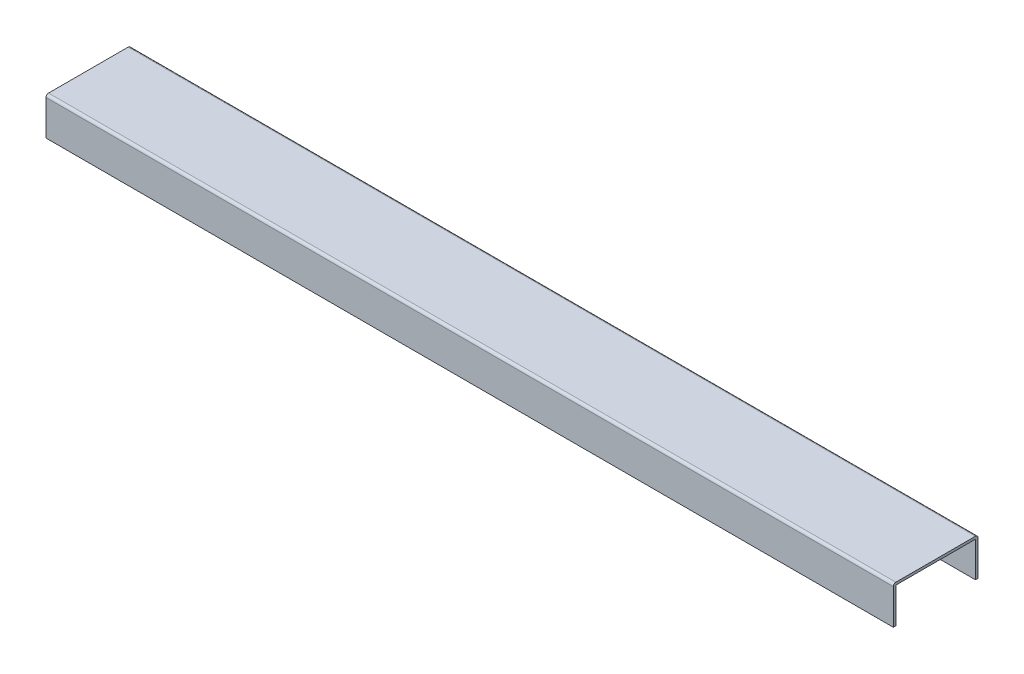
ISO-10303-21;
HEADER;
FILE_DESCRIPTION(('STEP AP214'),'2;1');
FILE_NAME('part.step','',(''),(''),'','','');
FILE_SCHEMA(('AUTOMOTIVE_DESIGN { 1 0 10303 214 1 1 1 1 }'));
ENDSEC;
DATA;
#1=APPLICATION_CONTEXT('core data for automotive mechanical design processes');
#2=APPLICATION_PROTOCOL_DEFINITION('international standard','automotive_design',2000,#1);
#3=PRODUCT_CONTEXT('',#1,'mechanical');
#4=PRODUCT('Part','Part','',(#3));
#5=PRODUCT_RELATED_PRODUCT_CATEGORY('part','',(#4));
#6=PRODUCT_DEFINITION_FORMATION('','',#4);
#7=PRODUCT_DEFINITION_CONTEXT('part definition',#1,'design');
#8=PRODUCT_DEFINITION('design','',#6,#7);
#9=PRODUCT_DEFINITION_SHAPE('','',#8);
#10=(LENGTH_UNIT() NAMED_UNIT(*) SI_UNIT(.MILLI.,.METRE.));
#11=(NAMED_UNIT(*) PLANE_ANGLE_UNIT() SI_UNIT($,.RADIAN.));
#12=(NAMED_UNIT(*) SI_UNIT($,.STERADIAN.) SOLID_ANGLE_UNIT());
#13=UNCERTAINTY_MEASURE_WITH_UNIT(LENGTH_MEASURE(1.E-05),#10,'distance_accuracy_value','');
#14=(GEOMETRIC_REPRESENTATION_CONTEXT(3) GLOBAL_UNCERTAINTY_ASSIGNED_CONTEXT((#13)) GLOBAL_UNIT_ASSIGNED_CONTEXT((#10,
#11,#12)) REPRESENTATION_CONTEXT('',''));
#15=CARTESIAN_POINT('',(0.,0.,0.));
#16=DIRECTION('',(0.,0.,1.));
#17=DIRECTION('',(1.,0.,0.));
#18=AXIS2_PLACEMENT_3D('',#15,#16,#17);
#19=CARTESIAN_POINT('',(1000.,3.,-3.));
#20=DIRECTION('',(1.,0.,0.));
#21=DIRECTION('',(0.,0.,-1.));
#22=AXIS2_PLACEMENT_3D('',#19,#20,#21);
#23=PLANE('',#22);
#24=DIRECTION('',(0.,0.,-1.));
#25=VECTOR('',#24,1.);
#26=CARTESIAN_POINT('',(1000.,55.462002836946,0.));
#27=LINE('',#26,#25);
#28=CARTESIAN_POINT('',(1000.,55.462002836946,-97.));
#29=VERTEX_POINT('',#28);
#30=CARTESIAN_POINT('',(1000.,55.462002836946,-100.));
#31=VERTEX_POINT('',#30);
#32=EDGE_CURVE('E91',#29,#31,#27,.T.);
#33=ORIENTED_EDGE('',*,*,#32,.T.);
#34=DIRECTION('',(0.,1.,0.));
#35=VECTOR('',#34,1.);
#36=CARTESIAN_POINT('',(1000.,3.,-100.));
#37=LINE('',#36,#35);
#38=CARTESIAN_POINT('',(1000.,97.,-100.));
#39=VERTEX_POINT('',#38);
#40=EDGE_CURVE('E179',#31,#39,#37,.T.);
#41=ORIENTED_EDGE('',*,*,#40,.T.);
#42=CARTESIAN_POINT('',(1000.,97.,-97.));
#43=DIRECTION('',(1.,0.,0.));
#44=DIRECTION('',(0.,0.,1.));
#45=AXIS2_PLACEMENT_3D('',#42,#43,#44);
#46=CIRCLE('',#45,3.);
#47=CARTESIAN_POINT('',(1000.,100.,-97.));
#48=VERTEX_POINT('',#47);
#49=EDGE_CURVE('E184',#39,#48,#46,.T.);
#50=ORIENTED_EDGE('',*,*,#49,.T.);
#51=DIRECTION('',(0.,0.,1.));
#52=VECTOR('',#51,1.);
#53=CARTESIAN_POINT('',(1000.,100.,-3.));
#54=LINE('',#53,#52);
#55=CARTESIAN_POINT('',(1000.,100.,-3.));
#56=VERTEX_POINT('',#55);
#57=EDGE_CURVE('E226',#48,#56,#54,.T.);
#58=ORIENTED_EDGE('',*,*,#57,.T.);
#59=CARTESIAN_POINT('',(1000.,97.,-3.));
#60=DIRECTION('',(1.,0.,0.));
#61=DIRECTION('',(0.,0.,1.));
#62=AXIS2_PLACEMENT_3D('',#59,#60,#61);
#63=CIRCLE('',#62,3.);
#64=CARTESIAN_POINT('',(1000.,97.,0.));
#65=VERTEX_POINT('',#64);
#66=EDGE_CURVE('E223',#56,#65,#63,.T.);
#67=ORIENTED_EDGE('',*,*,#66,.T.);
#68=DIRECTION('',(0.,-1.,0.));
#69=VECTOR('',#68,1.);
#70=CARTESIAN_POINT('',(1000.,3.00000000000002,0.));
#71=LINE('',#70,#69);
#72=CARTESIAN_POINT('',(1000.,55.462002836946,0.));
#73=VERTEX_POINT('',#72);
#74=EDGE_CURVE('E193',#65,#73,#71,.T.);
#75=ORIENTED_EDGE('',*,*,#74,.T.);
#76=CARTESIAN_POINT('',(1000.,55.462002836946,-3.));
#77=VERTEX_POINT('',#76);
#78=EDGE_CURVE('E153',#73,#77,#27,.T.);
#79=ORIENTED_EDGE('',*,*,#78,.T.);
#80=DIRECTION('',(0.,-1.,0.));
#81=VECTOR('',#80,1.);
#82=CARTESIAN_POINT('',(1000.,3.00000000000002,-3.));
#83=LINE('',#82,#81);
#84=CARTESIAN_POINT('',(1000.,97.,-3.));
#85=VERTEX_POINT('',#84);
#86=EDGE_CURVE('E237',#85,#77,#83,.T.);
#87=ORIENTED_EDGE('',*,*,#86,.F.);
#88=DIRECTION('',(0.,0.,1.));
#89=VECTOR('',#88,1.);
#90=CARTESIAN_POINT('',(1000.,97.,-3.));
#91=LINE('',#90,#89);
#92=CARTESIAN_POINT('',(1000.,97.,-97.));
#93=VERTEX_POINT('',#92);
#94=EDGE_CURVE('E251',#93,#85,#91,.T.);
#95=ORIENTED_EDGE('',*,*,#94,.F.);
#96=DIRECTION('',(0.,1.,0.));
#97=VECTOR('',#96,1.);
#98=CARTESIAN_POINT('',(1000.,3.,-97.));
#99=LINE('',#98,#97);
#100=EDGE_CURVE('E240',#29,#93,#99,.T.);
#101=ORIENTED_EDGE('',*,*,#100,.F.);
#102=EDGE_LOOP('',(#33,#41,#50,#58,#67,#75,#79,#87,#95,#101));
#103=FACE_BOUND('',#102,.T.);
#104=ADVANCED_FACE('F75',(#103),#23,.T.);
#105=CARTESIAN_POINT('',(0.,3.,-3.));
#106=DIRECTION('',(1.,0.,0.));
#107=DIRECTION('',(0.,0.,-1.));
#108=AXIS2_PLACEMENT_3D('',#105,#106,#107);
#109=PLANE('',#108);
#110=DIRECTION('',(0.,1.,0.));
#111=VECTOR('',#110,1.);
#112=CARTESIAN_POINT('',(0.,3.,-100.));
#113=LINE('',#112,#111);
#114=CARTESIAN_POINT('',(0.,55.462002836946,-100.));
#115=VERTEX_POINT('',#114);
#116=CARTESIAN_POINT('',(0.,97.,-100.));
#117=VERTEX_POINT('',#116);
#118=EDGE_CURVE('E213',#115,#117,#113,.T.);
#119=ORIENTED_EDGE('',*,*,#118,.F.);
#120=DIRECTION('',(0.,0.,-1.));
#121=VECTOR('',#120,1.);
#122=CARTESIAN_POINT('',(0.,55.462002836946,0.));
#123=LINE('',#122,#121);
#124=CARTESIAN_POINT('',(0.,55.462002836946,-97.));
#125=VERTEX_POINT('',#124);
#126=EDGE_CURVE('E159',#125,#115,#123,.T.);
#127=ORIENTED_EDGE('',*,*,#126,.F.);
#128=DIRECTION('',(0.,1.,0.));
#129=VECTOR('',#128,1.);
#130=CARTESIAN_POINT('',(0.,3.,-97.));
#131=LINE('',#130,#129);
#132=CARTESIAN_POINT('',(0.,97.,-97.));
#133=VERTEX_POINT('',#132);
#134=EDGE_CURVE('E244',#125,#133,#131,.T.);
#135=ORIENTED_EDGE('',*,*,#134,.T.);
#136=DIRECTION('',(0.,0.,1.));
#137=VECTOR('',#136,1.);
#138=CARTESIAN_POINT('',(0.,97.,-3.));
#139=LINE('',#138,#137);
#140=CARTESIAN_POINT('',(0.,97.,-3.));
#141=VERTEX_POINT('',#140);
#142=EDGE_CURVE('E241',#133,#141,#139,.T.);
#143=ORIENTED_EDGE('',*,*,#142,.T.);
#144=DIRECTION('',(0.,-1.,0.));
#145=VECTOR('',#144,1.);
#146=CARTESIAN_POINT('',(0.,3.00000000000002,-3.));
#147=LINE('',#146,#145);
#148=CARTESIAN_POINT('',(0.,55.462002836946,-3.));
#149=VERTEX_POINT('',#148);
#150=EDGE_CURVE('E171',#141,#149,#147,.T.);
#151=ORIENTED_EDGE('',*,*,#150,.T.);
#152=CARTESIAN_POINT('',(0.,55.462002836946,0.));
#153=VERTEX_POINT('',#152);
#154=EDGE_CURVE('E98',#153,#149,#123,.T.);
#155=ORIENTED_EDGE('',*,*,#154,.F.);
#156=DIRECTION('',(0.,-1.,0.));
#157=VECTOR('',#156,1.);
#158=CARTESIAN_POINT('',(0.,3.00000000000002,0.));
#159=LINE('',#158,#157);
#160=CARTESIAN_POINT('',(0.,97.,0.));
#161=VERTEX_POINT('',#160);
#162=EDGE_CURVE('E168',#161,#153,#159,.T.);
#163=ORIENTED_EDGE('',*,*,#162,.F.);
#164=CARTESIAN_POINT('',(0.,97.,-3.));
#165=DIRECTION('',(1.,0.,0.));
#166=DIRECTION('',(0.,0.,1.));
#167=AXIS2_PLACEMENT_3D('',#164,#165,#166);
#168=CIRCLE('',#167,3.);
#169=CARTESIAN_POINT('',(0.,100.,-3.));
#170=VERTEX_POINT('',#169);
#171=EDGE_CURVE('E180',#170,#161,#168,.T.);
#172=ORIENTED_EDGE('',*,*,#171,.F.);
#173=DIRECTION('',(0.,0.,1.));
#174=VECTOR('',#173,1.);
#175=CARTESIAN_POINT('',(0.,100.,-3.));
#176=LINE('',#175,#174);
#177=CARTESIAN_POINT('',(0.,100.,-97.));
#178=VERTEX_POINT('',#177);
#179=EDGE_CURVE('E186',#178,#170,#176,.T.);
#180=ORIENTED_EDGE('',*,*,#179,.F.);
#181=CARTESIAN_POINT('',(0.,97.,-97.));
#182=DIRECTION('',(1.,0.,0.));
#183=DIRECTION('',(0.,0.,1.));
#184=AXIS2_PLACEMENT_3D('',#181,#182,#183);
#185=CIRCLE('',#184,3.);
#186=EDGE_CURVE('E208',#117,#178,#185,.T.);
#187=ORIENTED_EDGE('',*,*,#186,.F.);
#188=EDGE_LOOP('',(#119,#127,#135,#143,#151,#155,#163,#172,#180,#187));
#189=FACE_BOUND('',#188,.T.);
#190=ADVANCED_FACE('F166',(#189),#109,.F.);
#191=CARTESIAN_POINT('',(1000.,3.,-100.));
#192=DIRECTION('',(0.,0.,1.));
#193=DIRECTION('',(1.,0.,0.));
#194=AXIS2_PLACEMENT_3D('',#191,#192,#193);
#195=PLANE('',#194);
#196=ORIENTED_EDGE('',*,*,#40,.F.);
#197=DIRECTION('',(1.,0.,0.));
#198=VECTOR('',#197,1.);
#199=CARTESIAN_POINT('',(1000.,55.462002836946,-100.));
#200=LINE('',#199,#198);
#201=EDGE_CURVE('E160',#115,#31,#200,.T.);
#202=ORIENTED_EDGE('',*,*,#201,.F.);
#203=ORIENTED_EDGE('',*,*,#118,.T.);
#204=DIRECTION('',(-1.,0.,0.));
#205=VECTOR('',#204,1.);
#206=CARTESIAN_POINT('',(1000.,97.,-100.));
#207=LINE('',#206,#205);
#208=EDGE_CURVE('E84',#39,#117,#207,.T.);
#209=ORIENTED_EDGE('',*,*,#208,.F.);
#210=EDGE_LOOP('',(#196,#202,#203,#209));
#211=FACE_BOUND('',#210,.T.);
#212=ADVANCED_FACE('F77',(#211),#195,.F.);
#213=CARTESIAN_POINT('',(1000.,97.,-97.));
#214=DIRECTION('',(-1.,0.,0.));
#215=DIRECTION('',(0.,0.,1.));
#216=AXIS2_PLACEMENT_3D('',#213,#214,#215);
#217=CYLINDRICAL_SURFACE('',#216,3.);
#218=ORIENTED_EDGE('',*,*,#186,.T.);
#219=DIRECTION('',(-1.,0.,0.));
#220=VECTOR('',#219,1.);
#221=CARTESIAN_POINT('',(1000.,100.,-97.));
#222=LINE('',#221,#220);
#223=EDGE_CURVE('E197',#48,#178,#222,.T.);
#224=ORIENTED_EDGE('',*,*,#223,.F.);
#225=ORIENTED_EDGE('',*,*,#49,.F.);
#226=ORIENTED_EDGE('',*,*,#208,.T.);
#227=EDGE_LOOP('',(#218,#224,#225,#226));
#228=FACE_BOUND('',#227,.T.);
#229=ADVANCED_FACE('F206',(#228),#217,.T.);
#230=CARTESIAN_POINT('',(1000.,100.,-3.));
#231=DIRECTION('',(0.,-1.,0.));
#232=DIRECTION('',(0.,0.,-1.));
#233=AXIS2_PLACEMENT_3D('',#230,#231,#232);
#234=PLANE('',#233);
#235=ORIENTED_EDGE('',*,*,#179,.T.);
#236=DIRECTION('',(-1.,0.,0.));
#237=VECTOR('',#236,1.);
#238=CARTESIAN_POINT('',(1000.,100.,-3.));
#239=LINE('',#238,#237);
#240=EDGE_CURVE('E192',#56,#170,#239,.T.);
#241=ORIENTED_EDGE('',*,*,#240,.F.);
#242=ORIENTED_EDGE('',*,*,#57,.F.);
#243=ORIENTED_EDGE('',*,*,#223,.T.);
#244=EDGE_LOOP('',(#235,#241,#242,#243));
#245=FACE_BOUND('',#244,.T.);
#246=ADVANCED_FACE('F273',(#245),#234,.F.);
#247=CARTESIAN_POINT('',(1000.,97.,-3.));
#248=DIRECTION('',(-1.,0.,0.));
#249=DIRECTION('',(0.,0.,1.));
#250=AXIS2_PLACEMENT_3D('',#247,#248,#249);
#251=CYLINDRICAL_SURFACE('',#250,3.);
#252=ORIENTED_EDGE('',*,*,#171,.T.);
#253=DIRECTION('',(-1.,0.,0.));
#254=VECTOR('',#253,1.);
#255=CARTESIAN_POINT('',(1000.,97.,0.));
#256=LINE('',#255,#254);
#257=EDGE_CURVE('E177',#65,#161,#256,.T.);
#258=ORIENTED_EDGE('',*,*,#257,.F.);
#259=ORIENTED_EDGE('',*,*,#66,.F.);
#260=ORIENTED_EDGE('',*,*,#240,.T.);
#261=EDGE_LOOP('',(#252,#258,#259,#260));
#262=FACE_BOUND('',#261,.T.);
#263=ADVANCED_FACE('F285',(#262),#251,.T.);
#264=CARTESIAN_POINT('',(1000.,3.00000000000002,0.));
#265=DIRECTION('',(0.,0.,-1.));
#266=DIRECTION('',(-1.,0.,0.));
#267=AXIS2_PLACEMENT_3D('',#264,#265,#266);
#268=PLANE('',#267);
#269=ORIENTED_EDGE('',*,*,#162,.T.);
#270=DIRECTION('',(1.,0.,0.));
#271=VECTOR('',#270,1.);
#272=CARTESIAN_POINT('',(1000.,55.462002836946,0.));
#273=LINE('',#272,#271);
#274=EDGE_CURVE('E150',#153,#73,#273,.T.);
#275=ORIENTED_EDGE('',*,*,#274,.T.);
#276=ORIENTED_EDGE('',*,*,#74,.F.);
#277=ORIENTED_EDGE('',*,*,#257,.T.);
#278=EDGE_LOOP('',(#269,#275,#276,#277));
#279=FACE_BOUND('',#278,.T.);
#280=ADVANCED_FACE('F175',(#279),#268,.F.);
#281=CARTESIAN_POINT('',(1000.,3.,-97.));
#282=DIRECTION('',(0.,0.,1.));
#283=DIRECTION('',(1.,0.,0.));
#284=AXIS2_PLACEMENT_3D('',#281,#282,#283);
#285=PLANE('',#284);
#286=DIRECTION('',(-1.,0.,0.));
#287=VECTOR('',#286,1.);
#288=CARTESIAN_POINT('',(1000.,55.462002836946,-97.));
#289=LINE('',#288,#287);
#290=EDGE_CURVE('E247',#29,#125,#289,.T.);
#291=ORIENTED_EDGE('',*,*,#290,.F.);
#292=ORIENTED_EDGE('',*,*,#100,.T.);
#293=DIRECTION('',(-1.,0.,0.));
#294=VECTOR('',#293,1.);
#295=CARTESIAN_POINT('',(1000.,97.,-97.));
#296=LINE('',#295,#294);
#297=EDGE_CURVE('E218',#93,#133,#296,.T.);
#298=ORIENTED_EDGE('',*,*,#297,.T.);
#299=ORIENTED_EDGE('',*,*,#134,.F.);
#300=EDGE_LOOP('',(#291,#292,#298,#299));
#301=FACE_BOUND('',#300,.T.);
#302=ADVANCED_FACE('F280',(#301),#285,.T.);
#303=CARTESIAN_POINT('',(1000.,97.,-3.));
#304=DIRECTION('',(0.,-1.,0.));
#305=DIRECTION('',(0.,0.,-1.));
#306=AXIS2_PLACEMENT_3D('',#303,#304,#305);
#307=PLANE('',#306);
#308=ORIENTED_EDGE('',*,*,#142,.F.);
#309=ORIENTED_EDGE('',*,*,#297,.F.);
#310=ORIENTED_EDGE('',*,*,#94,.T.);
#311=DIRECTION('',(-1.,0.,0.));
#312=VECTOR('',#311,1.);
#313=CARTESIAN_POINT('',(1000.,97.,-3.));
#314=LINE('',#313,#312);
#315=EDGE_CURVE('E234',#85,#141,#314,.T.);
#316=ORIENTED_EDGE('',*,*,#315,.T.);
#317=EDGE_LOOP('',(#308,#309,#310,#316));
#318=FACE_BOUND('',#317,.T.);
#319=ADVANCED_FACE('F302',(#318),#307,.T.);
#320=CARTESIAN_POINT('',(1000.,3.00000000000002,-3.));
#321=DIRECTION('',(0.,0.,-1.));
#322=DIRECTION('',(-1.,0.,0.));
#323=AXIS2_PLACEMENT_3D('',#320,#321,#322);
#324=PLANE('',#323);
#325=DIRECTION('',(1.,0.,0.));
#326=VECTOR('',#325,1.);
#327=CARTESIAN_POINT('',(1000.,55.462002836946,-3.));
#328=LINE('',#327,#326);
#329=EDGE_CURVE('E12',#149,#77,#328,.T.);
#330=ORIENTED_EDGE('',*,*,#329,.F.);
#331=ORIENTED_EDGE('',*,*,#150,.F.);
#332=ORIENTED_EDGE('',*,*,#315,.F.);
#333=ORIENTED_EDGE('',*,*,#86,.T.);
#334=EDGE_LOOP('',(#330,#331,#332,#333));
#335=FACE_BOUND('',#334,.T.);
#336=ADVANCED_FACE('F298',(#335),#324,.T.);
#337=CARTESIAN_POINT('',(1000.,55.462002836946,0.));
#338=DIRECTION('',(0.,1.,0.));
#339=DIRECTION('',(0.,0.,1.));
#340=AXIS2_PLACEMENT_3D('',#337,#338,#339);
#341=PLANE('',#340);
#342=ORIENTED_EDGE('',*,*,#329,.T.);
#343=ORIENTED_EDGE('',*,*,#78,.F.);
#344=ORIENTED_EDGE('',*,*,#274,.F.);
#345=ORIENTED_EDGE('',*,*,#154,.T.);
#346=EDGE_LOOP('',(#342,#343,#344,#345));
#347=FACE_BOUND('',#346,.T.);
#348=ADVANCED_FACE('F151',(#347),#341,.F.);
#349=ORIENTED_EDGE('',*,*,#290,.T.);
#350=ORIENTED_EDGE('',*,*,#126,.T.);
#351=ORIENTED_EDGE('',*,*,#201,.T.);
#352=ORIENTED_EDGE('',*,*,#32,.F.);
#353=EDGE_LOOP('',(#349,#350,#351,#352));
#354=FACE_BOUND('',#353,.T.);
#355=ADVANCED_FACE('F263',(#354),#341,.F.);
#356=CLOSED_SHELL('',(#104,#190,#212,#229,#246,#263,#280,#302,#319,#336,#348,#355));
#357=MANIFOLD_SOLID_BREP('B2',#356);
#358=ADVANCED_BREP_SHAPE_REPRESENTATION('',(#18,#357),#14);
#359=SHAPE_DEFINITION_REPRESENTATION(#9,#358);
ENDSEC;
END-ISO-10303-21;
